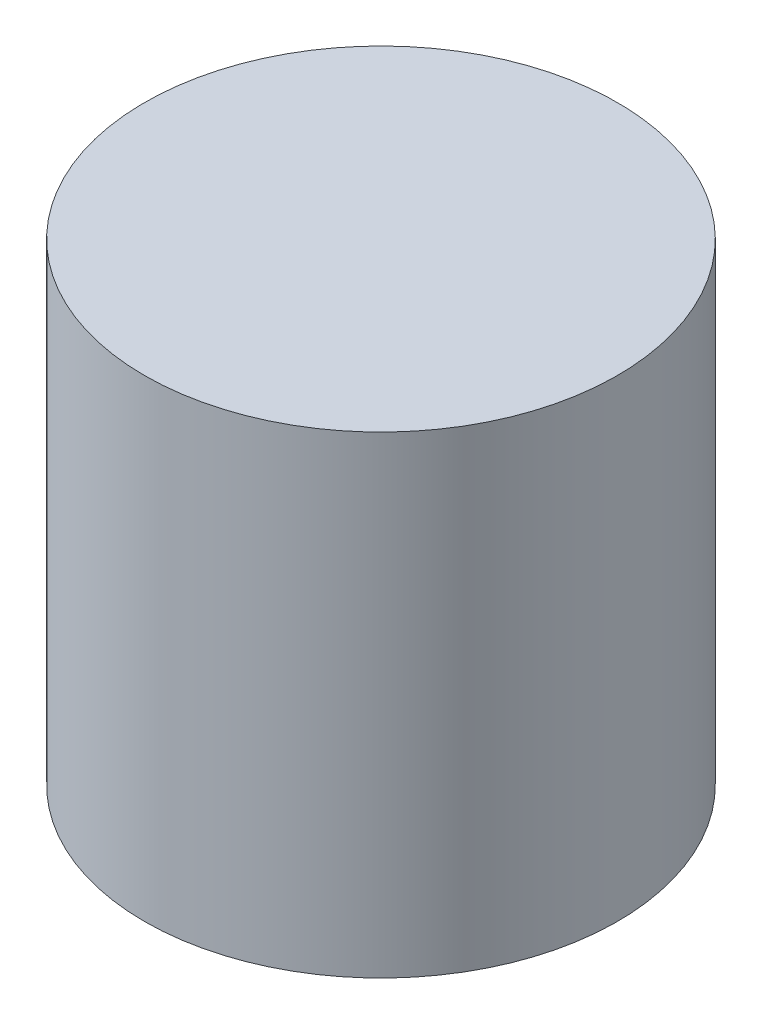
ISO-10303-21;
HEADER;
FILE_DESCRIPTION(('STEP AP214'),'2;1');
FILE_NAME('part.step','',(''),(''),'','','');
FILE_SCHEMA(('AUTOMOTIVE_DESIGN { 1 0 10303 214 1 1 1 1 }'));
ENDSEC;
DATA;
#1=APPLICATION_CONTEXT('core data for automotive mechanical design processes');
#2=APPLICATION_PROTOCOL_DEFINITION('international standard','automotive_design',2000,#1);
#3=PRODUCT_CONTEXT('',#1,'mechanical');
#4=PRODUCT('Part','Part','',(#3));
#5=PRODUCT_RELATED_PRODUCT_CATEGORY('part','',(#4));
#6=PRODUCT_DEFINITION_FORMATION('','',#4);
#7=PRODUCT_DEFINITION_CONTEXT('part definition',#1,'design');
#8=PRODUCT_DEFINITION('design','',#6,#7);
#9=PRODUCT_DEFINITION_SHAPE('','',#8);
#10=(LENGTH_UNIT() NAMED_UNIT(*) SI_UNIT(.MILLI.,.METRE.));
#11=(NAMED_UNIT(*) PLANE_ANGLE_UNIT() SI_UNIT($,.RADIAN.));
#12=(NAMED_UNIT(*) SI_UNIT($,.STERADIAN.) SOLID_ANGLE_UNIT());
#13=UNCERTAINTY_MEASURE_WITH_UNIT(LENGTH_MEASURE(1.E-05),#10,'distance_accuracy_value','');
#14=(GEOMETRIC_REPRESENTATION_CONTEXT(3) GLOBAL_UNCERTAINTY_ASSIGNED_CONTEXT((#13)) GLOBAL_UNIT_ASSIGNED_CONTEXT((#10,
#11,#12)) REPRESENTATION_CONTEXT('',''));
#15=CARTESIAN_POINT('',(0.,0.,0.));
#16=DIRECTION('',(0.,0.,1.));
#17=DIRECTION('',(1.,0.,0.));
#18=AXIS2_PLACEMENT_3D('',#15,#16,#17);
#19=CARTESIAN_POINT('',(0.,2.,0.));
#20=DIRECTION('',(0.,-1.,0.));
#21=DIRECTION('',(0.,0.,-1.));
#22=AXIS2_PLACEMENT_3D('',#19,#20,#21);
#23=CYLINDRICAL_SURFACE('',#22,1.);
#24=CARTESIAN_POINT('',(0.,2.,0.));
#25=DIRECTION('',(0.,1.,0.));
#26=DIRECTION('',(0.,0.,1.));
#27=AXIS2_PLACEMENT_3D('',#24,#25,#26);
#28=CIRCLE('',#27,1.);
#29=CARTESIAN_POINT('',(0.,2.,1.));
#30=VERTEX_POINT('',#29);
#31=EDGE_CURVE('E10',#30,#30,#28,.T.);
#32=ORIENTED_EDGE('',*,*,#31,.F.);
#33=EDGE_LOOP('',(#32));
#34=FACE_BOUND('',#33,.T.);
#35=CARTESIAN_POINT('',(0.,0.,0.));
#36=DIRECTION('',(0.,1.,0.));
#37=DIRECTION('',(0.,0.,1.));
#38=AXIS2_PLACEMENT_3D('',#35,#36,#37);
#39=CIRCLE('',#38,1.);
#40=CARTESIAN_POINT('',(0.,0.,1.));
#41=VERTEX_POINT('',#40);
#42=EDGE_CURVE('E46',#41,#41,#39,.T.);
#43=ORIENTED_EDGE('',*,*,#42,.T.);
#44=EDGE_LOOP('',(#43));
#45=FACE_BOUND('',#44,.T.);
#46=ADVANCED_FACE('F43',(#34,#45),#23,.T.);
#47=CARTESIAN_POINT('',(0.,2.,0.));
#48=DIRECTION('',(0.,1.,0.));
#49=DIRECTION('',(0.,0.,1.));
#50=AXIS2_PLACEMENT_3D('',#47,#48,#49);
#51=PLANE('',#50);
#52=ORIENTED_EDGE('',*,*,#31,.T.);
#53=EDGE_LOOP('',(#52));
#54=FACE_BOUND('',#53,.T.);
#55=ADVANCED_FACE('F60',(#54),#51,.T.);
#56=CARTESIAN_POINT('',(0.,0.,0.));
#57=DIRECTION('',(0.,1.,0.));
#58=DIRECTION('',(0.,0.,1.));
#59=AXIS2_PLACEMENT_3D('',#56,#57,#58);
#60=PLANE('',#59);
#61=ORIENTED_EDGE('',*,*,#42,.F.);
#62=EDGE_LOOP('',(#61));
#63=FACE_BOUND('',#62,.T.);
#64=ADVANCED_FACE('F58',(#63),#60,.F.);
#65=CLOSED_SHELL('',(#46,#55,#64));
#66=MANIFOLD_SOLID_BREP('B2',#65);
#67=ADVANCED_BREP_SHAPE_REPRESENTATION('',(#18,#66),#14);
#68=SHAPE_DEFINITION_REPRESENTATION(#9,#67);
ENDSEC;
END-ISO-10303-21;
